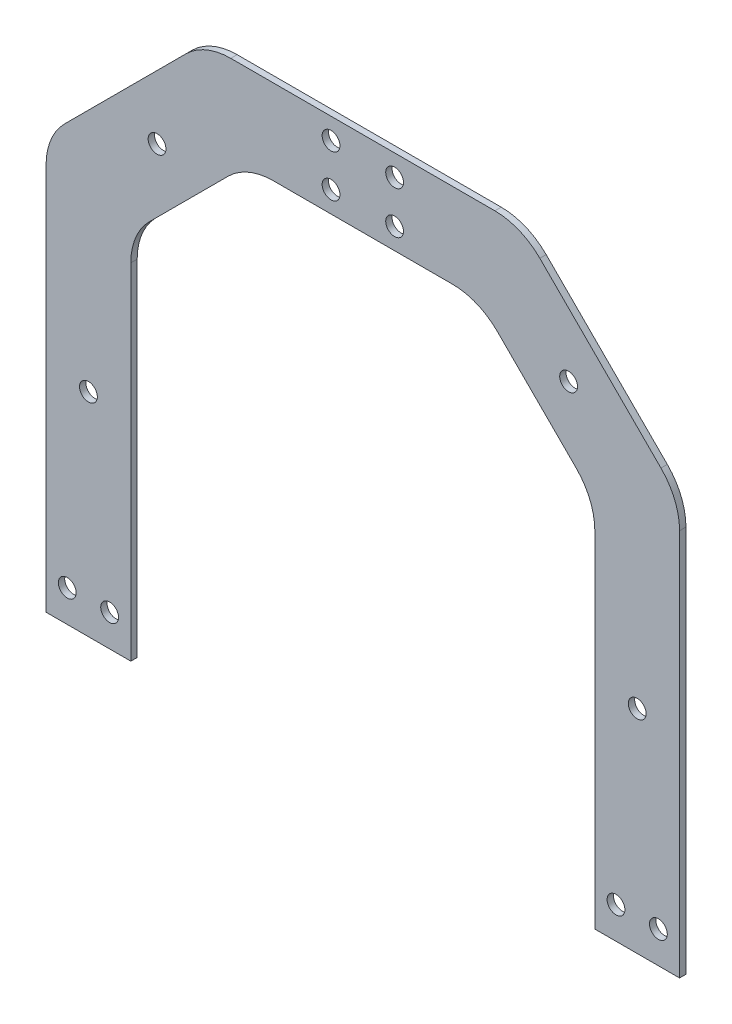
ISO-10303-21;
HEADER;
FILE_DESCRIPTION(('STEP AP214'),'2;1');
FILE_NAME('part.step','',(''),(''),'','','');
FILE_SCHEMA(('AUTOMOTIVE_DESIGN { 1 0 10303 214 1 1 1 1 }'));
ENDSEC;
DATA;
#1=APPLICATION_CONTEXT('core data for automotive mechanical design processes');
#2=APPLICATION_PROTOCOL_DEFINITION('international standard','automotive_design',2000,#1);
#3=PRODUCT_CONTEXT('',#1,'mechanical');
#4=PRODUCT('Part','Part','',(#3));
#5=PRODUCT_RELATED_PRODUCT_CATEGORY('part','',(#4));
#6=PRODUCT_DEFINITION_FORMATION('','',#4);
#7=PRODUCT_DEFINITION_CONTEXT('part definition',#1,'design');
#8=PRODUCT_DEFINITION('design','',#6,#7);
#9=PRODUCT_DEFINITION_SHAPE('','',#8);
#10=(LENGTH_UNIT() NAMED_UNIT(*) SI_UNIT(.MILLI.,.METRE.));
#11=(NAMED_UNIT(*) PLANE_ANGLE_UNIT() SI_UNIT($,.RADIAN.));
#12=(NAMED_UNIT(*) SI_UNIT($,.STERADIAN.) SOLID_ANGLE_UNIT());
#13=UNCERTAINTY_MEASURE_WITH_UNIT(LENGTH_MEASURE(1.E-05),#10,'distance_accuracy_value','');
#14=(GEOMETRIC_REPRESENTATION_CONTEXT(3) GLOBAL_UNCERTAINTY_ASSIGNED_CONTEXT((#13)) GLOBAL_UNIT_ASSIGNED_CONTEXT((#10,
#11,#12)) REPRESENTATION_CONTEXT('',''));
#15=CARTESIAN_POINT('',(0.,0.,0.));
#16=DIRECTION('',(0.,0.,1.));
#17=DIRECTION('',(1.,0.,0.));
#18=AXIS2_PLACEMENT_3D('',#15,#16,#17);
#19=CARTESIAN_POINT('',(109.5,0.,3.));
#20=DIRECTION('',(0.,1.,0.));
#21=DIRECTION('',(-1.,0.,0.));
#22=AXIS2_PLACEMENT_3D('',#19,#20,#21);
#23=PLANE('',#22);
#24=DIRECTION('',(1.,0.,0.));
#25=VECTOR('',#24,1.);
#26=CARTESIAN_POINT('',(109.5,0.,0.));
#27=LINE('',#26,#25);
#28=CARTESIAN_POINT('',(109.5,0.,0.));
#29=VERTEX_POINT('',#28);
#30=CARTESIAN_POINT('',(149.5,0.,0.));
#31=VERTEX_POINT('',#30);
#32=EDGE_CURVE('E203',#29,#31,#27,.T.);
#33=ORIENTED_EDGE('',*,*,#32,.T.);
#34=DIRECTION('',(0.,0.,-1.));
#35=VECTOR('',#34,1.);
#36=CARTESIAN_POINT('',(149.5,0.,3.));
#37=LINE('',#36,#35);
#38=CARTESIAN_POINT('',(149.5,0.,3.));
#39=VERTEX_POINT('',#38);
#40=EDGE_CURVE('E11',#39,#31,#37,.T.);
#41=ORIENTED_EDGE('',*,*,#40,.F.);
#42=DIRECTION('',(1.,0.,0.));
#43=VECTOR('',#42,1.);
#44=CARTESIAN_POINT('',(109.5,0.,3.));
#45=LINE('',#44,#43);
#46=CARTESIAN_POINT('',(109.5,0.,3.));
#47=VERTEX_POINT('',#46);
#48=EDGE_CURVE('E242',#47,#39,#45,.T.);
#49=ORIENTED_EDGE('',*,*,#48,.F.);
#50=DIRECTION('',(0.,0.,-1.));
#51=VECTOR('',#50,1.);
#52=CARTESIAN_POINT('',(109.5,0.,3.));
#53=LINE('',#52,#51);
#54=EDGE_CURVE('E199',#47,#29,#53,.T.);
#55=ORIENTED_EDGE('',*,*,#54,.T.);
#56=EDGE_LOOP('',(#33,#41,#49,#55));
#57=FACE_BOUND('',#56,.T.);
#58=ADVANCED_FACE('F35',(#57),#23,.F.);
#59=CARTESIAN_POINT('',(149.5,182.823593128805,3.));
#60=DIRECTION('',(-1.,0.,0.));
#61=DIRECTION('',(0.,0.,1.));
#62=AXIS2_PLACEMENT_3D('',#59,#60,#61);
#63=PLANE('',#62);
#64=DIRECTION('',(0.,1.,0.));
#65=VECTOR('',#64,1.);
#66=CARTESIAN_POINT('',(149.5,182.823593128805,0.));
#67=LINE('',#66,#65);
#68=CARTESIAN_POINT('',(149.5,182.823593128805,0.));
#69=VERTEX_POINT('',#68);
#70=EDGE_CURVE('E206',#31,#69,#67,.T.);
#71=ORIENTED_EDGE('',*,*,#70,.T.);
#72=DIRECTION('',(0.,0.,-1.));
#73=VECTOR('',#72,1.);
#74=CARTESIAN_POINT('',(149.5,182.823593128805,3.));
#75=LINE('',#74,#73);
#76=CARTESIAN_POINT('',(149.5,182.823593128805,3.));
#77=VERTEX_POINT('',#76);
#78=EDGE_CURVE('E43',#77,#69,#75,.T.);
#79=ORIENTED_EDGE('',*,*,#78,.F.);
#80=DIRECTION('',(0.,1.,0.));
#81=VECTOR('',#80,1.);
#82=CARTESIAN_POINT('',(149.5,182.823593128805,3.));
#83=LINE('',#82,#81);
#84=EDGE_CURVE('E130',#39,#77,#83,.T.);
#85=ORIENTED_EDGE('',*,*,#84,.F.);
#86=ORIENTED_EDGE('',*,*,#40,.T.);
#87=EDGE_LOOP('',(#71,#79,#85,#86));
#88=FACE_BOUND('',#87,.T.);
#89=ADVANCED_FACE('F361',(#88),#63,.F.);
#90=CARTESIAN_POINT('',(119.499999999992,182.823593128805,3.));
#91=DIRECTION('',(0.,0.,-1.));
#92=DIRECTION('',(-1.,0.,0.));
#93=AXIS2_PLACEMENT_3D('',#90,#91,#92);
#94=CYLINDRICAL_SURFACE('',#93,30.0000000000081);
#95=CARTESIAN_POINT('',(119.499999999992,182.823593128805,0.));
#96=DIRECTION('',(0.,0.,1.));
#97=DIRECTION('',(1.,0.,0.));
#98=AXIS2_PLACEMENT_3D('',#95,#96,#97);
#99=CIRCLE('',#98,30.0000000000081);
#100=CARTESIAN_POINT('',(140.713203435594,204.036796564407,0.));
#101=VERTEX_POINT('',#100);
#102=EDGE_CURVE('E209',#69,#101,#99,.T.);
#103=ORIENTED_EDGE('',*,*,#102,.T.);
#104=DIRECTION('',(0.,0.,-1.));
#105=VECTOR('',#104,1.);
#106=CARTESIAN_POINT('',(140.713203435594,204.036796564407,3.));
#107=LINE('',#106,#105);
#108=CARTESIAN_POINT('',(140.713203435594,204.036796564407,3.));
#109=VERTEX_POINT('',#108);
#110=EDGE_CURVE('E285',#109,#101,#107,.T.);
#111=ORIENTED_EDGE('',*,*,#110,.F.);
#112=CARTESIAN_POINT('',(119.499999999992,182.823593128805,3.));
#113=DIRECTION('',(0.,0.,1.));
#114=DIRECTION('',(1.,0.,0.));
#115=AXIS2_PLACEMENT_3D('',#112,#113,#114);
#116=CIRCLE('',#115,30.0000000000081);
#117=EDGE_CURVE('E293',#77,#109,#116,.T.);
#118=ORIENTED_EDGE('',*,*,#117,.F.);
#119=ORIENTED_EDGE('',*,*,#78,.T.);
#120=EDGE_LOOP('',(#103,#111,#118,#119));
#121=FACE_BOUND('',#120,.T.);
#122=ADVANCED_FACE('F291',(#121),#94,.T.);
#123=CARTESIAN_POINT('',(83.536796564406,261.213203435594,3.));
#124=DIRECTION('',(-0.707106781186544,-0.707106781186551,0.));
#125=DIRECTION('',(0.707106781186551,-0.707106781186544,0.));
#126=AXIS2_PLACEMENT_3D('',#123,#124,#125);
#127=PLANE('',#126);
#128=DIRECTION('',(-0.707106781186551,0.707106781186544,0.));
#129=VECTOR('',#128,1.);
#130=CARTESIAN_POINT('',(83.536796564406,261.213203435594,0.));
#131=LINE('',#130,#129);
#132=CARTESIAN_POINT('',(83.536796564406,261.213203435594,0.));
#133=VERTEX_POINT('',#132);
#134=EDGE_CURVE('E211',#101,#133,#131,.T.);
#135=ORIENTED_EDGE('',*,*,#134,.T.);
#136=DIRECTION('',(0.,0.,-1.));
#137=VECTOR('',#136,1.);
#138=CARTESIAN_POINT('',(83.536796564406,261.213203435594,3.));
#139=LINE('',#138,#137);
#140=CARTESIAN_POINT('',(83.536796564406,261.213203435594,3.));
#141=VERTEX_POINT('',#140);
#142=EDGE_CURVE('E282',#141,#133,#139,.T.);
#143=ORIENTED_EDGE('',*,*,#142,.F.);
#144=DIRECTION('',(-0.707106781186551,0.707106781186544,0.));
#145=VECTOR('',#144,1.);
#146=CARTESIAN_POINT('',(83.536796564406,261.213203435594,3.));
#147=LINE('',#146,#145);
#148=EDGE_CURVE('E311',#109,#141,#147,.T.);
#149=ORIENTED_EDGE('',*,*,#148,.F.);
#150=ORIENTED_EDGE('',*,*,#110,.T.);
#151=EDGE_LOOP('',(#135,#143,#149,#150));
#152=FACE_BOUND('',#151,.T.);
#153=ADVANCED_FACE('F302',(#152),#127,.F.);
#154=CARTESIAN_POINT('',(62.323593128804,239.999999999992,3.));
#155=DIRECTION('',(0.,0.,-1.));
#156=DIRECTION('',(-1.,0.,0.));
#157=AXIS2_PLACEMENT_3D('',#154,#155,#156);
#158=CYLINDRICAL_SURFACE('',#157,30.0000000000081);
#159=CARTESIAN_POINT('',(62.323593128804,239.999999999992,0.));
#160=DIRECTION('',(0.,0.,1.));
#161=DIRECTION('',(1.,0.,0.));
#162=AXIS2_PLACEMENT_3D('',#159,#160,#161);
#163=CIRCLE('',#162,30.0000000000081);
#164=CARTESIAN_POINT('',(62.323593128804,270.,0.));
#165=VERTEX_POINT('',#164);
#166=EDGE_CURVE('E213',#133,#165,#163,.T.);
#167=ORIENTED_EDGE('',*,*,#166,.T.);
#168=DIRECTION('',(0.,0.,-1.));
#169=VECTOR('',#168,1.);
#170=CARTESIAN_POINT('',(62.323593128804,270.,3.));
#171=LINE('',#170,#169);
#172=CARTESIAN_POINT('',(62.323593128804,270.,3.));
#173=VERTEX_POINT('',#172);
#174=EDGE_CURVE('E279',#173,#165,#171,.T.);
#175=ORIENTED_EDGE('',*,*,#174,.F.);
#176=CARTESIAN_POINT('',(62.323593128804,239.999999999992,3.));
#177=DIRECTION('',(0.,0.,1.));
#178=DIRECTION('',(1.,0.,0.));
#179=AXIS2_PLACEMENT_3D('',#176,#177,#178);
#180=CIRCLE('',#179,30.0000000000081);
#181=EDGE_CURVE('E308',#141,#173,#180,.T.);
#182=ORIENTED_EDGE('',*,*,#181,.F.);
#183=ORIENTED_EDGE('',*,*,#142,.T.);
#184=EDGE_LOOP('',(#167,#175,#182,#183));
#185=FACE_BOUND('',#184,.T.);
#186=ADVANCED_FACE('F306',(#185),#158,.T.);
#187=CARTESIAN_POINT('',(62.323593128804,270.,3.));
#188=DIRECTION('',(0.,-1.,0.));
#189=DIRECTION('',(0.,0.,-1.));
#190=AXIS2_PLACEMENT_3D('',#187,#188,#189);
#191=PLANE('',#190);
#192=DIRECTION('',(-1.,0.,0.));
#193=VECTOR('',#192,1.);
#194=CARTESIAN_POINT('',(62.323593128804,270.,0.));
#195=LINE('',#194,#193);
#196=CARTESIAN_POINT('',(-62.323593128804,270.,0.));
#197=VERTEX_POINT('',#196);
#198=EDGE_CURVE('E215',#165,#197,#195,.T.);
#199=ORIENTED_EDGE('',*,*,#198,.T.);
#200=DIRECTION('',(0.,0.,-1.));
#201=VECTOR('',#200,1.);
#202=CARTESIAN_POINT('',(-62.323593128804,270.,3.));
#203=LINE('',#202,#201);
#204=CARTESIAN_POINT('',(-62.323593128804,270.,3.));
#205=VERTEX_POINT('',#204);
#206=EDGE_CURVE('E276',#205,#197,#203,.T.);
#207=ORIENTED_EDGE('',*,*,#206,.F.);
#208=DIRECTION('',(-1.,0.,0.));
#209=VECTOR('',#208,1.);
#210=CARTESIAN_POINT('',(62.323593128804,270.,3.));
#211=LINE('',#210,#209);
#212=EDGE_CURVE('E310',#173,#205,#211,.T.);
#213=ORIENTED_EDGE('',*,*,#212,.F.);
#214=ORIENTED_EDGE('',*,*,#174,.T.);
#215=EDGE_LOOP('',(#199,#207,#213,#214));
#216=FACE_BOUND('',#215,.T.);
#217=ADVANCED_FACE('F374',(#216),#191,.F.);
#218=CARTESIAN_POINT('',(-62.323593128804,239.999999999992,3.));
#219=DIRECTION('',(0.,0.,-1.));
#220=DIRECTION('',(-1.,0.,0.));
#221=AXIS2_PLACEMENT_3D('',#218,#219,#220);
#222=CYLINDRICAL_SURFACE('',#221,30.0000000000081);
#223=CARTESIAN_POINT('',(-62.323593128804,239.999999999992,0.));
#224=DIRECTION('',(0.,0.,1.));
#225=DIRECTION('',(-1.,0.,0.));
#226=AXIS2_PLACEMENT_3D('',#223,#224,#225);
#227=CIRCLE('',#226,30.0000000000081);
#228=CARTESIAN_POINT('',(-83.536796564406,261.213203435594,0.));
#229=VERTEX_POINT('',#228);
#230=EDGE_CURVE('E217',#197,#229,#227,.T.);
#231=ORIENTED_EDGE('',*,*,#230,.T.);
#232=DIRECTION('',(0.,0.,-1.));
#233=VECTOR('',#232,1.);
#234=CARTESIAN_POINT('',(-83.536796564406,261.213203435594,3.));
#235=LINE('',#234,#233);
#236=CARTESIAN_POINT('',(-83.536796564406,261.213203435594,3.));
#237=VERTEX_POINT('',#236);
#238=EDGE_CURVE('E273',#237,#229,#235,.T.);
#239=ORIENTED_EDGE('',*,*,#238,.F.);
#240=CARTESIAN_POINT('',(-62.323593128804,239.999999999992,3.));
#241=DIRECTION('',(0.,0.,1.));
#242=DIRECTION('',(-1.,0.,0.));
#243=AXIS2_PLACEMENT_3D('',#240,#241,#242);
#244=CIRCLE('',#243,30.0000000000081);
#245=EDGE_CURVE('E313',#205,#237,#244,.T.);
#246=ORIENTED_EDGE('',*,*,#245,.F.);
#247=ORIENTED_EDGE('',*,*,#206,.T.);
#248=EDGE_LOOP('',(#231,#239,#246,#247));
#249=FACE_BOUND('',#248,.T.);
#250=ADVANCED_FACE('F377',(#249),#222,.T.);
#251=CARTESIAN_POINT('',(-83.536796564406,261.213203435594,3.));
#252=DIRECTION('',(0.707106781186544,-0.707106781186551,0.));
#253=DIRECTION('',(0.707106781186551,0.707106781186544,0.));
#254=AXIS2_PLACEMENT_3D('',#251,#252,#253);
#255=PLANE('',#254);
#256=DIRECTION('',(-0.707106781186551,-0.707106781186544,0.));
#257=VECTOR('',#256,1.);
#258=CARTESIAN_POINT('',(-83.536796564406,261.213203435594,0.));
#259=LINE('',#258,#257);
#260=CARTESIAN_POINT('',(-140.713203435594,204.036796564407,0.));
#261=VERTEX_POINT('',#260);
#262=EDGE_CURVE('E219',#229,#261,#259,.T.);
#263=ORIENTED_EDGE('',*,*,#262,.T.);
#264=DIRECTION('',(0.,0.,-1.));
#265=VECTOR('',#264,1.);
#266=CARTESIAN_POINT('',(-140.713203435594,204.036796564407,3.));
#267=LINE('',#266,#265);
#268=CARTESIAN_POINT('',(-140.713203435594,204.036796564407,3.));
#269=VERTEX_POINT('',#268);
#270=EDGE_CURVE('E270',#269,#261,#267,.T.);
#271=ORIENTED_EDGE('',*,*,#270,.F.);
#272=DIRECTION('',(-0.707106781186551,-0.707106781186544,0.));
#273=VECTOR('',#272,1.);
#274=CARTESIAN_POINT('',(-83.536796564406,261.213203435594,3.));
#275=LINE('',#274,#273);
#276=EDGE_CURVE('E319',#237,#269,#275,.T.);
#277=ORIENTED_EDGE('',*,*,#276,.F.);
#278=ORIENTED_EDGE('',*,*,#238,.T.);
#279=EDGE_LOOP('',(#263,#271,#277,#278));
#280=FACE_BOUND('',#279,.T.);
#281=ADVANCED_FACE('F381',(#280),#255,.F.);
#282=CARTESIAN_POINT('',(-119.499999999992,182.823593128805,3.));
#283=DIRECTION('',(0.,0.,-1.));
#284=DIRECTION('',(-1.,0.,0.));
#285=AXIS2_PLACEMENT_3D('',#282,#283,#284);
#286=CYLINDRICAL_SURFACE('',#285,30.0000000000081);
#287=CARTESIAN_POINT('',(-119.499999999992,182.823593128805,0.));
#288=DIRECTION('',(0.,0.,1.));
#289=DIRECTION('',(1.,0.,0.));
#290=AXIS2_PLACEMENT_3D('',#287,#288,#289);
#291=CIRCLE('',#290,30.0000000000081);
#292=CARTESIAN_POINT('',(-149.5,182.823593128805,0.));
#293=VERTEX_POINT('',#292);
#294=EDGE_CURVE('E221',#261,#293,#291,.T.);
#295=ORIENTED_EDGE('',*,*,#294,.T.);
#296=DIRECTION('',(0.,0.,-1.));
#297=VECTOR('',#296,1.);
#298=CARTESIAN_POINT('',(-149.5,182.823593128805,3.));
#299=LINE('',#298,#297);
#300=CARTESIAN_POINT('',(-149.5,182.823593128805,3.));
#301=VERTEX_POINT('',#300);
#302=EDGE_CURVE('E267',#301,#293,#299,.T.);
#303=ORIENTED_EDGE('',*,*,#302,.F.);
#304=CARTESIAN_POINT('',(-119.499999999992,182.823593128805,3.));
#305=DIRECTION('',(0.,0.,1.));
#306=DIRECTION('',(1.,0.,0.));
#307=AXIS2_PLACEMENT_3D('',#304,#305,#306);
#308=CIRCLE('',#307,30.0000000000081);
#309=EDGE_CURVE('E321',#269,#301,#308,.T.);
#310=ORIENTED_EDGE('',*,*,#309,.F.);
#311=ORIENTED_EDGE('',*,*,#270,.T.);
#312=EDGE_LOOP('',(#295,#303,#310,#311));
#313=FACE_BOUND('',#312,.T.);
#314=ADVANCED_FACE('F385',(#313),#286,.T.);
#315=CARTESIAN_POINT('',(-149.5,182.823593128805,3.));
#316=DIRECTION('',(1.,0.,0.));
#317=DIRECTION('',(0.,0.,-1.));
#318=AXIS2_PLACEMENT_3D('',#315,#316,#317);
#319=PLANE('',#318);
#320=DIRECTION('',(0.,-1.,0.));
#321=VECTOR('',#320,1.);
#322=CARTESIAN_POINT('',(-149.5,182.823593128805,0.));
#323=LINE('',#322,#321);
#324=CARTESIAN_POINT('',(-149.5,0.,0.));
#325=VERTEX_POINT('',#324);
#326=EDGE_CURVE('E223',#293,#325,#323,.T.);
#327=ORIENTED_EDGE('',*,*,#326,.T.);
#328=DIRECTION('',(0.,0.,-1.));
#329=VECTOR('',#328,1.);
#330=CARTESIAN_POINT('',(-149.5,0.,3.));
#331=LINE('',#330,#329);
#332=CARTESIAN_POINT('',(-149.5,0.,3.));
#333=VERTEX_POINT('',#332);
#334=EDGE_CURVE('E264',#333,#325,#331,.T.);
#335=ORIENTED_EDGE('',*,*,#334,.F.);
#336=DIRECTION('',(0.,-1.,0.));
#337=VECTOR('',#336,1.);
#338=CARTESIAN_POINT('',(-149.5,182.823593128805,3.));
#339=LINE('',#338,#337);
#340=EDGE_CURVE('E323',#301,#333,#339,.T.);
#341=ORIENTED_EDGE('',*,*,#340,.F.);
#342=ORIENTED_EDGE('',*,*,#302,.T.);
#343=EDGE_LOOP('',(#327,#335,#341,#342));
#344=FACE_BOUND('',#343,.T.);
#345=ADVANCED_FACE('F389',(#344),#319,.F.);
#346=CARTESIAN_POINT('',(-109.5,0.,3.));
#347=DIRECTION('',(0.,1.,0.));
#348=DIRECTION('',(-1.,0.,0.));
#349=AXIS2_PLACEMENT_3D('',#346,#347,#348);
#350=PLANE('',#349);
#351=DIRECTION('',(1.,0.,0.));
#352=VECTOR('',#351,1.);
#353=CARTESIAN_POINT('',(-109.5,0.,0.));
#354=LINE('',#353,#352);
#355=CARTESIAN_POINT('',(-109.5,0.,0.));
#356=VERTEX_POINT('',#355);
#357=EDGE_CURVE('E225',#325,#356,#354,.T.);
#358=ORIENTED_EDGE('',*,*,#357,.T.);
#359=DIRECTION('',(0.,0.,-1.));
#360=VECTOR('',#359,1.);
#361=CARTESIAN_POINT('',(-109.5,0.,3.));
#362=LINE('',#361,#360);
#363=CARTESIAN_POINT('',(-109.5,0.,3.));
#364=VERTEX_POINT('',#363);
#365=EDGE_CURVE('E261',#364,#356,#362,.T.);
#366=ORIENTED_EDGE('',*,*,#365,.F.);
#367=DIRECTION('',(1.,0.,0.));
#368=VECTOR('',#367,1.);
#369=CARTESIAN_POINT('',(-109.5,0.,3.));
#370=LINE('',#369,#368);
#371=EDGE_CURVE('E325',#333,#364,#370,.T.);
#372=ORIENTED_EDGE('',*,*,#371,.F.);
#373=ORIENTED_EDGE('',*,*,#334,.T.);
#374=EDGE_LOOP('',(#358,#366,#372,#373));
#375=FACE_BOUND('',#374,.T.);
#376=ADVANCED_FACE('F393',(#375),#350,.F.);
#377=CARTESIAN_POINT('',(-109.5,162.823593128805,3.));
#378=DIRECTION('',(-1.,0.,0.));
#379=DIRECTION('',(0.,-1.,0.));
#380=AXIS2_PLACEMENT_3D('',#377,#378,#379);
#381=PLANE('',#380);
#382=DIRECTION('',(0.,1.,0.));
#383=VECTOR('',#382,1.);
#384=CARTESIAN_POINT('',(-109.5,162.823593128805,0.));
#385=LINE('',#384,#383);
#386=CARTESIAN_POINT('',(-109.5,162.823593128805,0.));
#387=VERTEX_POINT('',#386);
#388=EDGE_CURVE('E227',#356,#387,#385,.T.);
#389=ORIENTED_EDGE('',*,*,#388,.T.);
#390=DIRECTION('',(0.,0.,-1.));
#391=VECTOR('',#390,1.);
#392=CARTESIAN_POINT('',(-109.5,162.823593128805,3.));
#393=LINE('',#392,#391);
#394=CARTESIAN_POINT('',(-109.5,162.823593128805,3.));
#395=VERTEX_POINT('',#394);
#396=EDGE_CURVE('E258',#395,#387,#393,.T.);
#397=ORIENTED_EDGE('',*,*,#396,.F.);
#398=DIRECTION('',(0.,1.,0.));
#399=VECTOR('',#398,1.);
#400=CARTESIAN_POINT('',(-109.5,162.823593128805,3.));
#401=LINE('',#400,#399);
#402=EDGE_CURVE('E327',#364,#395,#401,.T.);
#403=ORIENTED_EDGE('',*,*,#402,.F.);
#404=ORIENTED_EDGE('',*,*,#365,.T.);
#405=EDGE_LOOP('',(#389,#397,#403,#404));
#406=FACE_BOUND('',#405,.T.);
#407=ADVANCED_FACE('F397',(#406),#381,.F.);
#408=CARTESIAN_POINT('',(-79.4999999999919,162.823593128805,3.));
#409=DIRECTION('',(0.,0.,-1.));
#410=DIRECTION('',(-1.,0.,0.));
#411=AXIS2_PLACEMENT_3D('',#408,#409,#410);
#412=CYLINDRICAL_SURFACE('',#411,30.0000000000081);
#413=CARTESIAN_POINT('',(-79.4999999999919,162.823593128805,0.));
#414=DIRECTION('',(0.,0.,-1.));
#415=DIRECTION('',(1.,0.,0.));
#416=AXIS2_PLACEMENT_3D('',#413,#414,#415);
#417=CIRCLE('',#416,30.0000000000081);
#418=CARTESIAN_POINT('',(-100.713203435594,184.036796564407,0.));
#419=VERTEX_POINT('',#418);
#420=EDGE_CURVE('E229',#387,#419,#417,.T.);
#421=ORIENTED_EDGE('',*,*,#420,.T.);
#422=DIRECTION('',(0.,0.,-1.));
#423=VECTOR('',#422,1.);
#424=CARTESIAN_POINT('',(-100.713203435594,184.036796564407,3.));
#425=LINE('',#424,#423);
#426=CARTESIAN_POINT('',(-100.713203435594,184.036796564407,3.));
#427=VERTEX_POINT('',#426);
#428=EDGE_CURVE('E255',#427,#419,#425,.T.);
#429=ORIENTED_EDGE('',*,*,#428,.F.);
#430=CARTESIAN_POINT('',(-79.4999999999919,162.823593128805,3.));
#431=DIRECTION('',(0.,0.,-1.));
#432=DIRECTION('',(1.,0.,0.));
#433=AXIS2_PLACEMENT_3D('',#430,#431,#432);
#434=CIRCLE('',#433,30.0000000000081);
#435=EDGE_CURVE('E329',#395,#427,#434,.T.);
#436=ORIENTED_EDGE('',*,*,#435,.F.);
#437=ORIENTED_EDGE('',*,*,#396,.T.);
#438=EDGE_LOOP('',(#421,#429,#436,#437));
#439=FACE_BOUND('',#438,.T.);
#440=ADVANCED_FACE('F401',(#439),#412,.F.);
#441=CARTESIAN_POINT('',(-63.5367965644059,221.213203435594,3.));
#442=DIRECTION('',(-0.707106781186539,0.707106781186556,0.));
#443=DIRECTION('',(-0.707106781186556,-0.707106781186539,0.));
#444=AXIS2_PLACEMENT_3D('',#441,#442,#443);
#445=PLANE('',#444);
#446=DIRECTION('',(0.707106781186556,0.707106781186539,0.));
#447=VECTOR('',#446,1.);
#448=CARTESIAN_POINT('',(-63.5367965644059,221.213203435594,0.));
#449=LINE('',#448,#447);
#450=CARTESIAN_POINT('',(-63.5367965644059,221.213203435594,0.));
#451=VERTEX_POINT('',#450);
#452=EDGE_CURVE('E231',#419,#451,#449,.T.);
#453=ORIENTED_EDGE('',*,*,#452,.T.);
#454=DIRECTION('',(0.,0.,-1.));
#455=VECTOR('',#454,1.);
#456=CARTESIAN_POINT('',(-63.5367965644059,221.213203435594,3.));
#457=LINE('',#456,#455);
#458=CARTESIAN_POINT('',(-63.5367965644059,221.213203435594,3.));
#459=VERTEX_POINT('',#458);
#460=EDGE_CURVE('E252',#459,#451,#457,.T.);
#461=ORIENTED_EDGE('',*,*,#460,.F.);
#462=DIRECTION('',(0.707106781186556,0.707106781186539,0.));
#463=VECTOR('',#462,1.);
#464=CARTESIAN_POINT('',(-63.5367965644059,221.213203435594,3.));
#465=LINE('',#464,#463);
#466=EDGE_CURVE('E331',#427,#459,#465,.T.);
#467=ORIENTED_EDGE('',*,*,#466,.F.);
#468=ORIENTED_EDGE('',*,*,#428,.T.);
#469=EDGE_LOOP('',(#453,#461,#467,#468));
#470=FACE_BOUND('',#469,.T.);
#471=ADVANCED_FACE('F405',(#470),#445,.F.);
#472=CARTESIAN_POINT('',(-42.323593128804,199.999999999992,3.));
#473=DIRECTION('',(0.,0.,-1.));
#474=DIRECTION('',(-1.,0.,0.));
#475=AXIS2_PLACEMENT_3D('',#472,#473,#474);
#476=CYLINDRICAL_SURFACE('',#475,30.0000000000081);
#477=CARTESIAN_POINT('',(-42.323593128804,199.999999999992,0.));
#478=DIRECTION('',(0.,0.,-1.));
#479=DIRECTION('',(-1.,0.,0.));
#480=AXIS2_PLACEMENT_3D('',#477,#478,#479);
#481=CIRCLE('',#480,30.0000000000081);
#482=CARTESIAN_POINT('',(-42.323593128804,230.,0.));
#483=VERTEX_POINT('',#482);
#484=EDGE_CURVE('E233',#451,#483,#481,.T.);
#485=ORIENTED_EDGE('',*,*,#484,.T.);
#486=DIRECTION('',(0.,0.,-1.));
#487=VECTOR('',#486,1.);
#488=CARTESIAN_POINT('',(-42.323593128804,230.,3.));
#489=LINE('',#488,#487);
#490=CARTESIAN_POINT('',(-42.323593128804,230.,3.));
#491=VERTEX_POINT('',#490);
#492=EDGE_CURVE('E249',#491,#483,#489,.T.);
#493=ORIENTED_EDGE('',*,*,#492,.F.);
#494=CARTESIAN_POINT('',(-42.323593128804,199.999999999992,3.));
#495=DIRECTION('',(0.,0.,-1.));
#496=DIRECTION('',(-1.,0.,0.));
#497=AXIS2_PLACEMENT_3D('',#494,#495,#496);
#498=CIRCLE('',#497,30.0000000000081);
#499=EDGE_CURVE('E333',#459,#491,#498,.T.);
#500=ORIENTED_EDGE('',*,*,#499,.F.);
#501=ORIENTED_EDGE('',*,*,#460,.T.);
#502=EDGE_LOOP('',(#485,#493,#500,#501));
#503=FACE_BOUND('',#502,.T.);
#504=ADVANCED_FACE('F409',(#503),#476,.F.);
#505=CARTESIAN_POINT('',(42.323593128804,230.,3.));
#506=DIRECTION('',(0.,1.,0.));
#507=DIRECTION('',(0.,0.,1.));
#508=AXIS2_PLACEMENT_3D('',#505,#506,#507);
#509=PLANE('',#508);
#510=DIRECTION('',(1.,0.,0.));
#511=VECTOR('',#510,1.);
#512=CARTESIAN_POINT('',(42.323593128804,230.,0.));
#513=LINE('',#512,#511);
#514=CARTESIAN_POINT('',(42.323593128804,230.,0.));
#515=VERTEX_POINT('',#514);
#516=EDGE_CURVE('E235',#483,#515,#513,.T.);
#517=ORIENTED_EDGE('',*,*,#516,.T.);
#518=DIRECTION('',(0.,0.,-1.));
#519=VECTOR('',#518,1.);
#520=CARTESIAN_POINT('',(42.323593128804,230.,3.));
#521=LINE('',#520,#519);
#522=CARTESIAN_POINT('',(42.323593128804,230.,3.));
#523=VERTEX_POINT('',#522);
#524=EDGE_CURVE('E246',#523,#515,#521,.T.);
#525=ORIENTED_EDGE('',*,*,#524,.F.);
#526=DIRECTION('',(1.,0.,0.));
#527=VECTOR('',#526,1.);
#528=CARTESIAN_POINT('',(42.323593128804,230.,3.));
#529=LINE('',#528,#527);
#530=EDGE_CURVE('E335',#491,#523,#529,.T.);
#531=ORIENTED_EDGE('',*,*,#530,.F.);
#532=ORIENTED_EDGE('',*,*,#492,.T.);
#533=EDGE_LOOP('',(#517,#525,#531,#532));
#534=FACE_BOUND('',#533,.T.);
#535=ADVANCED_FACE('F341',(#534),#509,.F.);
#536=CARTESIAN_POINT('',(42.323593128804,199.999999999992,3.));
#537=DIRECTION('',(0.,0.,-1.));
#538=DIRECTION('',(-1.,0.,0.));
#539=AXIS2_PLACEMENT_3D('',#536,#537,#538);
#540=CYLINDRICAL_SURFACE('',#539,30.0000000000081);
#541=CARTESIAN_POINT('',(42.323593128804,199.999999999992,0.));
#542=DIRECTION('',(0.,0.,-1.));
#543=DIRECTION('',(1.,0.,0.));
#544=AXIS2_PLACEMENT_3D('',#541,#542,#543);
#545=CIRCLE('',#544,30.0000000000081);
#546=CARTESIAN_POINT('',(63.5367965644058,221.213203435594,0.));
#547=VERTEX_POINT('',#546);
#548=EDGE_CURVE('E237',#515,#547,#545,.T.);
#549=ORIENTED_EDGE('',*,*,#548,.T.);
#550=DIRECTION('',(0.,0.,-1.));
#551=VECTOR('',#550,1.);
#552=CARTESIAN_POINT('',(63.5367965644058,221.213203435594,3.));
#553=LINE('',#552,#551);
#554=CARTESIAN_POINT('',(63.5367965644058,221.213203435594,3.));
#555=VERTEX_POINT('',#554);
#556=EDGE_CURVE('E194',#555,#547,#553,.T.);
#557=ORIENTED_EDGE('',*,*,#556,.F.);
#558=CARTESIAN_POINT('',(42.323593128804,199.999999999992,3.));
#559=DIRECTION('',(0.,0.,-1.));
#560=DIRECTION('',(1.,0.,0.));
#561=AXIS2_PLACEMENT_3D('',#558,#559,#560);
#562=CIRCLE('',#561,30.0000000000081);
#563=EDGE_CURVE('E185',#523,#555,#562,.T.);
#564=ORIENTED_EDGE('',*,*,#563,.F.);
#565=ORIENTED_EDGE('',*,*,#524,.T.);
#566=EDGE_LOOP('',(#549,#557,#564,#565));
#567=FACE_BOUND('',#566,.T.);
#568=ADVANCED_FACE('F345',(#567),#540,.F.);
#569=CARTESIAN_POINT('',(63.5367965644059,221.213203435594,3.));
#570=DIRECTION('',(0.707106781186539,0.707106781186556,0.));
#571=DIRECTION('',(-0.707106781186556,0.707106781186539,0.));
#572=AXIS2_PLACEMENT_3D('',#569,#570,#571);
#573=PLANE('',#572);
#574=DIRECTION('',(0.707106781186556,-0.707106781186539,0.));
#575=VECTOR('',#574,1.);
#576=CARTESIAN_POINT('',(63.5367965644059,221.213203435594,0.));
#577=LINE('',#576,#575);
#578=CARTESIAN_POINT('',(100.713203435594,184.036796564407,0.));
#579=VERTEX_POINT('',#578);
#580=EDGE_CURVE('E193',#547,#579,#577,.T.);
#581=ORIENTED_EDGE('',*,*,#580,.T.);
#582=DIRECTION('',(0.,0.,-1.));
#583=VECTOR('',#582,1.);
#584=CARTESIAN_POINT('',(100.713203435594,184.036796564407,3.));
#585=LINE('',#584,#583);
#586=CARTESIAN_POINT('',(100.713203435594,184.036796564407,3.));
#587=VERTEX_POINT('',#586);
#588=EDGE_CURVE('E190',#587,#579,#585,.T.);
#589=ORIENTED_EDGE('',*,*,#588,.F.);
#590=DIRECTION('',(0.707106781186556,-0.707106781186539,0.));
#591=VECTOR('',#590,1.);
#592=CARTESIAN_POINT('',(63.5367965644059,221.213203435594,3.));
#593=LINE('',#592,#591);
#594=EDGE_CURVE('E179',#555,#587,#593,.T.);
#595=ORIENTED_EDGE('',*,*,#594,.F.);
#596=ORIENTED_EDGE('',*,*,#556,.T.);
#597=EDGE_LOOP('',(#581,#589,#595,#596));
#598=FACE_BOUND('',#597,.T.);
#599=ADVANCED_FACE('F191',(#598),#573,.F.);
#600=CARTESIAN_POINT('',(79.4999999999919,162.823593128805,3.));
#601=DIRECTION('',(0.,0.,-1.));
#602=DIRECTION('',(-1.,0.,0.));
#603=AXIS2_PLACEMENT_3D('',#600,#601,#602);
#604=CYLINDRICAL_SURFACE('',#603,30.0000000000081);
#605=CARTESIAN_POINT('',(79.4999999999919,162.823593128805,0.));
#606=DIRECTION('',(0.,0.,-1.));
#607=DIRECTION('',(1.,0.,0.));
#608=AXIS2_PLACEMENT_3D('',#605,#606,#607);
#609=CIRCLE('',#608,30.0000000000081);
#610=CARTESIAN_POINT('',(109.5,162.823593128805,0.));
#611=VERTEX_POINT('',#610);
#612=EDGE_CURVE('E116',#579,#611,#609,.T.);
#613=ORIENTED_EDGE('',*,*,#612,.T.);
#614=DIRECTION('',(0.,0.,-1.));
#615=VECTOR('',#614,1.);
#616=CARTESIAN_POINT('',(109.5,162.823593128805,3.));
#617=LINE('',#616,#615);
#618=CARTESIAN_POINT('',(109.5,162.823593128805,3.));
#619=VERTEX_POINT('',#618);
#620=EDGE_CURVE('E195',#619,#611,#617,.T.);
#621=ORIENTED_EDGE('',*,*,#620,.F.);
#622=CARTESIAN_POINT('',(79.4999999999919,162.823593128805,3.));
#623=DIRECTION('',(0.,0.,-1.));
#624=DIRECTION('',(1.,0.,0.));
#625=AXIS2_PLACEMENT_3D('',#622,#623,#624);
#626=CIRCLE('',#625,30.0000000000081);
#627=EDGE_CURVE('E183',#587,#619,#626,.T.);
#628=ORIENTED_EDGE('',*,*,#627,.F.);
#629=ORIENTED_EDGE('',*,*,#588,.T.);
#630=EDGE_LOOP('',(#613,#621,#628,#629));
#631=FACE_BOUND('',#630,.T.);
#632=ADVANCED_FACE('F197',(#631),#604,.F.);
#633=CARTESIAN_POINT('',(109.5,162.823593128805,3.));
#634=DIRECTION('',(1.,0.,0.));
#635=DIRECTION('',(0.,1.,0.));
#636=AXIS2_PLACEMENT_3D('',#633,#634,#635);
#637=PLANE('',#636);
#638=DIRECTION('',(0.,-1.,0.));
#639=VECTOR('',#638,1.);
#640=CARTESIAN_POINT('',(109.5,162.823593128805,0.));
#641=LINE('',#640,#639);
#642=EDGE_CURVE('E122',#611,#29,#641,.T.);
#643=ORIENTED_EDGE('',*,*,#642,.T.);
#644=ORIENTED_EDGE('',*,*,#54,.F.);
#645=DIRECTION('',(0.,-1.,0.));
#646=VECTOR('',#645,1.);
#647=CARTESIAN_POINT('',(109.5,162.823593128805,3.));
#648=LINE('',#647,#646);
#649=EDGE_CURVE('E51',#619,#47,#648,.T.);
#650=ORIENTED_EDGE('',*,*,#649,.F.);
#651=ORIENTED_EDGE('',*,*,#620,.T.);
#652=EDGE_LOOP('',(#643,#644,#650,#651));
#653=FACE_BOUND('',#652,.T.);
#654=ADVANCED_FACE('F349',(#653),#637,.F.);
#655=CARTESIAN_POINT('',(119.499999999992,182.823593128805,3.));
#656=DIRECTION('',(0.,0.,1.));
#657=DIRECTION('',(1.,0.,0.));
#658=AXIS2_PLACEMENT_3D('',#655,#656,#657);
#659=PLANE('',#658);
#660=CARTESIAN_POINT('',(-119.5,15.,3.));
#661=DIRECTION('',(0.,0.,1.));
#662=DIRECTION('',(1.,0.,0.));
#663=AXIS2_PLACEMENT_3D('',#660,#661,#662);
#664=CIRCLE('',#663,4.2);
#665=CARTESIAN_POINT('',(-115.3,15.,3.));
#666=VERTEX_POINT('',#665);
#667=EDGE_CURVE('E575',#666,#666,#664,.T.);
#668=ORIENTED_EDGE('',*,*,#667,.F.);
#669=EDGE_LOOP('',(#668));
#670=FACE_BOUND('',#669,.T.);
#671=CARTESIAN_POINT('',(-139.5,15.,3.));
#672=DIRECTION('',(0.,0.,1.));
#673=DIRECTION('',(1.,0.,0.));
#674=AXIS2_PLACEMENT_3D('',#671,#672,#673);
#675=CIRCLE('',#674,4.20000000000001);
#676=CARTESIAN_POINT('',(-135.3,15.,3.));
#677=VERTEX_POINT('',#676);
#678=EDGE_CURVE('E577',#677,#677,#675,.T.);
#679=ORIENTED_EDGE('',*,*,#678,.F.);
#680=EDGE_LOOP('',(#679));
#681=FACE_BOUND('',#680,.T.);
#682=CARTESIAN_POINT('',(139.5,15.,3.));
#683=DIRECTION('',(0.,0.,1.));
#684=DIRECTION('',(1.,0.,0.));
#685=AXIS2_PLACEMENT_3D('',#682,#683,#684);
#686=CIRCLE('',#685,4.20000000000001);
#687=CARTESIAN_POINT('',(143.7,15.,3.));
#688=VERTEX_POINT('',#687);
#689=EDGE_CURVE('E585',#688,#688,#686,.T.);
#690=ORIENTED_EDGE('',*,*,#689,.F.);
#691=EDGE_LOOP('',(#690));
#692=FACE_BOUND('',#691,.T.);
#693=CARTESIAN_POINT('',(-15.,260.,3.));
#694=DIRECTION('',(0.,0.,1.));
#695=DIRECTION('',(1.,0.,0.));
#696=AXIS2_PLACEMENT_3D('',#693,#694,#695);
#697=CIRCLE('',#696,4.2);
#698=CARTESIAN_POINT('',(-10.8,260.,3.));
#699=VERTEX_POINT('',#698);
#700=EDGE_CURVE('E591',#699,#699,#697,.T.);
#701=ORIENTED_EDGE('',*,*,#700,.F.);
#702=EDGE_LOOP('',(#701));
#703=FACE_BOUND('',#702,.T.);
#704=CARTESIAN_POINT('',(-15.,240.,3.));
#705=DIRECTION('',(0.,0.,1.));
#706=DIRECTION('',(1.,0.,0.));
#707=AXIS2_PLACEMENT_3D('',#704,#705,#706);
#708=CIRCLE('',#707,4.2);
#709=CARTESIAN_POINT('',(-10.8,240.,3.));
#710=VERTEX_POINT('',#709);
#711=EDGE_CURVE('E597',#710,#710,#708,.T.);
#712=ORIENTED_EDGE('',*,*,#711,.F.);
#713=EDGE_LOOP('',(#712));
#714=FACE_BOUND('',#713,.T.);
#715=CARTESIAN_POINT('',(15.,240.,3.));
#716=DIRECTION('',(0.,0.,1.));
#717=DIRECTION('',(1.,0.,0.));
#718=AXIS2_PLACEMENT_3D('',#715,#716,#717);
#719=CIRCLE('',#718,4.2);
#720=CARTESIAN_POINT('',(19.2,240.,3.));
#721=VERTEX_POINT('',#720);
#722=EDGE_CURVE('E603',#721,#721,#719,.T.);
#723=ORIENTED_EDGE('',*,*,#722,.F.);
#724=EDGE_LOOP('',(#723));
#725=FACE_BOUND('',#724,.T.);
#726=CARTESIAN_POINT('',(15.,260.,3.));
#727=DIRECTION('',(0.,0.,1.));
#728=DIRECTION('',(1.,0.,0.));
#729=AXIS2_PLACEMENT_3D('',#726,#727,#728);
#730=CIRCLE('',#729,4.2);
#731=CARTESIAN_POINT('',(19.2,260.,3.));
#732=VERTEX_POINT('',#731);
#733=EDGE_CURVE('E609',#732,#732,#730,.T.);
#734=ORIENTED_EDGE('',*,*,#733,.F.);
#735=EDGE_LOOP('',(#734));
#736=FACE_BOUND('',#735,.T.);
#737=CARTESIAN_POINT('',(-129.5,100.125,3.));
#738=DIRECTION('',(0.,0.,1.));
#739=DIRECTION('',(1.,0.,0.));
#740=AXIS2_PLACEMENT_3D('',#737,#738,#739);
#741=CIRCLE('',#740,4.20000000000001);
#742=CARTESIAN_POINT('',(-125.3,100.125,3.));
#743=VERTEX_POINT('',#742);
#744=EDGE_CURVE('E615',#743,#743,#741,.T.);
#745=ORIENTED_EDGE('',*,*,#744,.F.);
#746=EDGE_LOOP('',(#745));
#747=FACE_BOUND('',#746,.T.);
#748=CARTESIAN_POINT('',(-97.1250000000003,217.625,3.));
#749=DIRECTION('',(0.,0.,1.));
#750=DIRECTION('',(1.,0.,0.));
#751=AXIS2_PLACEMENT_3D('',#748,#749,#750);
#752=CIRCLE('',#751,4.2);
#753=CARTESIAN_POINT('',(-92.9250000000003,217.625,3.));
#754=VERTEX_POINT('',#753);
#755=EDGE_CURVE('E621',#754,#754,#752,.T.);
#756=ORIENTED_EDGE('',*,*,#755,.F.);
#757=EDGE_LOOP('',(#756));
#758=FACE_BOUND('',#757,.T.);
#759=CARTESIAN_POINT('',(129.5,100.125,3.));
#760=DIRECTION('',(0.,0.,1.));
#761=DIRECTION('',(1.,0.,0.));
#762=AXIS2_PLACEMENT_3D('',#759,#760,#761);
#763=CIRCLE('',#762,4.20000000000001);
#764=CARTESIAN_POINT('',(133.7,100.125,3.));
#765=VERTEX_POINT('',#764);
#766=EDGE_CURVE('E627',#765,#765,#763,.T.);
#767=ORIENTED_EDGE('',*,*,#766,.F.);
#768=EDGE_LOOP('',(#767));
#769=FACE_BOUND('',#768,.T.);
#770=CARTESIAN_POINT('',(97.1250000000003,217.625,3.));
#771=DIRECTION('',(0.,0.,1.));
#772=DIRECTION('',(1.,0.,0.));
#773=AXIS2_PLACEMENT_3D('',#770,#771,#772);
#774=CIRCLE('',#773,4.2);
#775=CARTESIAN_POINT('',(101.325,217.625,3.));
#776=VERTEX_POINT('',#775);
#777=EDGE_CURVE('E633',#776,#776,#774,.T.);
#778=ORIENTED_EDGE('',*,*,#777,.F.);
#779=EDGE_LOOP('',(#778));
#780=FACE_BOUND('',#779,.T.);
#781=CARTESIAN_POINT('',(119.5,15.0000000000001,3.));
#782=DIRECTION('',(0.,0.,1.));
#783=DIRECTION('',(1.,0.,0.));
#784=AXIS2_PLACEMENT_3D('',#781,#782,#783);
#785=CIRCLE('',#784,4.2);
#786=CARTESIAN_POINT('',(123.7,15.0000000000001,3.));
#787=VERTEX_POINT('',#786);
#788=EDGE_CURVE('E639',#787,#787,#785,.T.);
#789=ORIENTED_EDGE('',*,*,#788,.F.);
#790=EDGE_LOOP('',(#789));
#791=FACE_BOUND('',#790,.T.);
#792=ORIENTED_EDGE('',*,*,#48,.T.);
#793=ORIENTED_EDGE('',*,*,#84,.T.);
#794=ORIENTED_EDGE('',*,*,#117,.T.);
#795=ORIENTED_EDGE('',*,*,#148,.T.);
#796=ORIENTED_EDGE('',*,*,#181,.T.);
#797=ORIENTED_EDGE('',*,*,#212,.T.);
#798=ORIENTED_EDGE('',*,*,#245,.T.);
#799=ORIENTED_EDGE('',*,*,#276,.T.);
#800=ORIENTED_EDGE('',*,*,#309,.T.);
#801=ORIENTED_EDGE('',*,*,#340,.T.);
#802=ORIENTED_EDGE('',*,*,#371,.T.);
#803=ORIENTED_EDGE('',*,*,#402,.T.);
#804=ORIENTED_EDGE('',*,*,#435,.T.);
#805=ORIENTED_EDGE('',*,*,#466,.T.);
#806=ORIENTED_EDGE('',*,*,#499,.T.);
#807=ORIENTED_EDGE('',*,*,#530,.T.);
#808=ORIENTED_EDGE('',*,*,#563,.T.);
#809=ORIENTED_EDGE('',*,*,#594,.T.);
#810=ORIENTED_EDGE('',*,*,#627,.T.);
#811=ORIENTED_EDGE('',*,*,#649,.T.);
#812=EDGE_LOOP('',(#792,#793,#794,#795,#796,#797,#798,#799,#800,#801,#802,#803,#804,#805,#806,
#807,#808,#809,#810,#811));
#813=FACE_BOUND('',#812,.T.);
#814=ADVANCED_FACE('F181',(#670,#681,#692,#703,#714,#725,#736,#747,#758,#769,#780,#791,#813),
#659,.T.);
#815=CARTESIAN_POINT('',(119.499999999992,182.823593128805,0.));
#816=DIRECTION('',(0.,0.,1.));
#817=DIRECTION('',(1.,0.,0.));
#818=AXIS2_PLACEMENT_3D('',#815,#816,#817);
#819=PLANE('',#818);
#820=CARTESIAN_POINT('',(-119.5,15.,0.));
#821=DIRECTION('',(0.,0.,1.));
#822=DIRECTION('',(1.,0.,0.));
#823=AXIS2_PLACEMENT_3D('',#820,#821,#822);
#824=CIRCLE('',#823,4.2);
#825=CARTESIAN_POINT('',(-115.3,15.,0.));
#826=VERTEX_POINT('',#825);
#827=EDGE_CURVE('E572',#826,#826,#824,.T.);
#828=ORIENTED_EDGE('',*,*,#827,.T.);
#829=EDGE_LOOP('',(#828));
#830=FACE_BOUND('',#829,.T.);
#831=CARTESIAN_POINT('',(-139.5,15.,0.));
#832=DIRECTION('',(0.,0.,1.));
#833=DIRECTION('',(1.,0.,0.));
#834=AXIS2_PLACEMENT_3D('',#831,#832,#833);
#835=CIRCLE('',#834,4.20000000000001);
#836=CARTESIAN_POINT('',(-135.3,15.,0.));
#837=VERTEX_POINT('',#836);
#838=EDGE_CURVE('E582',#837,#837,#835,.T.);
#839=ORIENTED_EDGE('',*,*,#838,.T.);
#840=EDGE_LOOP('',(#839));
#841=FACE_BOUND('',#840,.T.);
#842=CARTESIAN_POINT('',(139.5,15.,0.));
#843=DIRECTION('',(0.,0.,1.));
#844=DIRECTION('',(1.,0.,0.));
#845=AXIS2_PLACEMENT_3D('',#842,#843,#844);
#846=CIRCLE('',#845,4.20000000000001);
#847=CARTESIAN_POINT('',(143.7,15.,0.));
#848=VERTEX_POINT('',#847);
#849=EDGE_CURVE('E588',#848,#848,#846,.T.);
#850=ORIENTED_EDGE('',*,*,#849,.T.);
#851=EDGE_LOOP('',(#850));
#852=FACE_BOUND('',#851,.T.);
#853=CARTESIAN_POINT('',(-15.,260.,0.));
#854=DIRECTION('',(0.,0.,1.));
#855=DIRECTION('',(1.,0.,0.));
#856=AXIS2_PLACEMENT_3D('',#853,#854,#855);
#857=CIRCLE('',#856,4.2);
#858=CARTESIAN_POINT('',(-10.8,260.,0.));
#859=VERTEX_POINT('',#858);
#860=EDGE_CURVE('E594',#859,#859,#857,.T.);
#861=ORIENTED_EDGE('',*,*,#860,.T.);
#862=EDGE_LOOP('',(#861));
#863=FACE_BOUND('',#862,.T.);
#864=CARTESIAN_POINT('',(-15.,240.,0.));
#865=DIRECTION('',(0.,0.,1.));
#866=DIRECTION('',(1.,0.,0.));
#867=AXIS2_PLACEMENT_3D('',#864,#865,#866);
#868=CIRCLE('',#867,4.2);
#869=CARTESIAN_POINT('',(-10.8,240.,0.));
#870=VERTEX_POINT('',#869);
#871=EDGE_CURVE('E600',#870,#870,#868,.T.);
#872=ORIENTED_EDGE('',*,*,#871,.T.);
#873=EDGE_LOOP('',(#872));
#874=FACE_BOUND('',#873,.T.);
#875=CARTESIAN_POINT('',(15.,240.,0.));
#876=DIRECTION('',(0.,0.,1.));
#877=DIRECTION('',(1.,0.,0.));
#878=AXIS2_PLACEMENT_3D('',#875,#876,#877);
#879=CIRCLE('',#878,4.2);
#880=CARTESIAN_POINT('',(19.2,240.,0.));
#881=VERTEX_POINT('',#880);
#882=EDGE_CURVE('E606',#881,#881,#879,.T.);
#883=ORIENTED_EDGE('',*,*,#882,.T.);
#884=EDGE_LOOP('',(#883));
#885=FACE_BOUND('',#884,.T.);
#886=CARTESIAN_POINT('',(15.,260.,0.));
#887=DIRECTION('',(0.,0.,1.));
#888=DIRECTION('',(1.,0.,0.));
#889=AXIS2_PLACEMENT_3D('',#886,#887,#888);
#890=CIRCLE('',#889,4.2);
#891=CARTESIAN_POINT('',(19.2,260.,0.));
#892=VERTEX_POINT('',#891);
#893=EDGE_CURVE('E612',#892,#892,#890,.T.);
#894=ORIENTED_EDGE('',*,*,#893,.T.);
#895=EDGE_LOOP('',(#894));
#896=FACE_BOUND('',#895,.T.);
#897=CARTESIAN_POINT('',(-129.5,100.125,0.));
#898=DIRECTION('',(0.,0.,1.));
#899=DIRECTION('',(1.,0.,0.));
#900=AXIS2_PLACEMENT_3D('',#897,#898,#899);
#901=CIRCLE('',#900,4.20000000000001);
#902=CARTESIAN_POINT('',(-125.3,100.125,0.));
#903=VERTEX_POINT('',#902);
#904=EDGE_CURVE('E618',#903,#903,#901,.T.);
#905=ORIENTED_EDGE('',*,*,#904,.T.);
#906=EDGE_LOOP('',(#905));
#907=FACE_BOUND('',#906,.T.);
#908=CARTESIAN_POINT('',(-97.1250000000003,217.625,0.));
#909=DIRECTION('',(0.,0.,1.));
#910=DIRECTION('',(1.,0.,0.));
#911=AXIS2_PLACEMENT_3D('',#908,#909,#910);
#912=CIRCLE('',#911,4.2);
#913=CARTESIAN_POINT('',(-92.9250000000003,217.625,0.));
#914=VERTEX_POINT('',#913);
#915=EDGE_CURVE('E624',#914,#914,#912,.T.);
#916=ORIENTED_EDGE('',*,*,#915,.T.);
#917=EDGE_LOOP('',(#916));
#918=FACE_BOUND('',#917,.T.);
#919=CARTESIAN_POINT('',(129.5,100.125,0.));
#920=DIRECTION('',(0.,0.,1.));
#921=DIRECTION('',(1.,0.,0.));
#922=AXIS2_PLACEMENT_3D('',#919,#920,#921);
#923=CIRCLE('',#922,4.20000000000001);
#924=CARTESIAN_POINT('',(133.7,100.125,0.));
#925=VERTEX_POINT('',#924);
#926=EDGE_CURVE('E630',#925,#925,#923,.T.);
#927=ORIENTED_EDGE('',*,*,#926,.T.);
#928=EDGE_LOOP('',(#927));
#929=FACE_BOUND('',#928,.T.);
#930=CARTESIAN_POINT('',(97.1250000000003,217.625,0.));
#931=DIRECTION('',(0.,0.,1.));
#932=DIRECTION('',(1.,0.,0.));
#933=AXIS2_PLACEMENT_3D('',#930,#931,#932);
#934=CIRCLE('',#933,4.2);
#935=CARTESIAN_POINT('',(101.325,217.625,0.));
#936=VERTEX_POINT('',#935);
#937=EDGE_CURVE('E636',#936,#936,#934,.T.);
#938=ORIENTED_EDGE('',*,*,#937,.T.);
#939=EDGE_LOOP('',(#938));
#940=FACE_BOUND('',#939,.T.);
#941=CARTESIAN_POINT('',(119.5,15.0000000000001,0.));
#942=DIRECTION('',(0.,0.,1.));
#943=DIRECTION('',(1.,0.,0.));
#944=AXIS2_PLACEMENT_3D('',#941,#942,#943);
#945=CIRCLE('',#944,4.2);
#946=CARTESIAN_POINT('',(123.7,15.0000000000001,0.));
#947=VERTEX_POINT('',#946);
#948=EDGE_CURVE('E207',#947,#947,#945,.T.);
#949=ORIENTED_EDGE('',*,*,#948,.T.);
#950=EDGE_LOOP('',(#949));
#951=FACE_BOUND('',#950,.T.);
#952=ORIENTED_EDGE('',*,*,#32,.F.);
#953=ORIENTED_EDGE('',*,*,#642,.F.);
#954=ORIENTED_EDGE('',*,*,#612,.F.);
#955=ORIENTED_EDGE('',*,*,#580,.F.);
#956=ORIENTED_EDGE('',*,*,#548,.F.);
#957=ORIENTED_EDGE('',*,*,#516,.F.);
#958=ORIENTED_EDGE('',*,*,#484,.F.);
#959=ORIENTED_EDGE('',*,*,#452,.F.);
#960=ORIENTED_EDGE('',*,*,#420,.F.);
#961=ORIENTED_EDGE('',*,*,#388,.F.);
#962=ORIENTED_EDGE('',*,*,#357,.F.);
#963=ORIENTED_EDGE('',*,*,#326,.F.);
#964=ORIENTED_EDGE('',*,*,#294,.F.);
#965=ORIENTED_EDGE('',*,*,#262,.F.);
#966=ORIENTED_EDGE('',*,*,#230,.F.);
#967=ORIENTED_EDGE('',*,*,#198,.F.);
#968=ORIENTED_EDGE('',*,*,#166,.F.);
#969=ORIENTED_EDGE('',*,*,#134,.F.);
#970=ORIENTED_EDGE('',*,*,#102,.F.);
#971=ORIENTED_EDGE('',*,*,#70,.F.);
#972=EDGE_LOOP('',(#952,#953,#954,#955,#956,#957,#958,#959,#960,#961,#962,#963,#964,#965,#966,
#967,#968,#969,#970,#971));
#973=FACE_BOUND('',#972,.T.);
#974=ADVANCED_FACE('F297',(#830,#841,#852,#863,#874,#885,#896,#907,#918,#929,#940,#951,#973),
#819,.F.);
#975=CARTESIAN_POINT('',(119.5,15.0000000000001,3.));
#976=DIRECTION('',(0.,0.,1.));
#977=DIRECTION('',(1.,0.,0.));
#978=AXIS2_PLACEMENT_3D('',#975,#976,#977);
#979=CYLINDRICAL_SURFACE('',#978,4.2);
#980=ORIENTED_EDGE('',*,*,#948,.F.);
#981=EDGE_LOOP('',(#980));
#982=FACE_BOUND('',#981,.T.);
#983=ORIENTED_EDGE('',*,*,#788,.T.);
#984=EDGE_LOOP('',(#983));
#985=FACE_BOUND('',#984,.T.);
#986=ADVANCED_FACE('F446',(#982,#985),#979,.F.);
#987=CARTESIAN_POINT('',(97.1250000000003,217.625,3.));
#988=DIRECTION('',(0.,0.,1.));
#989=DIRECTION('',(1.,0.,0.));
#990=AXIS2_PLACEMENT_3D('',#987,#988,#989);
#991=CYLINDRICAL_SURFACE('',#990,4.2);
#992=ORIENTED_EDGE('',*,*,#937,.F.);
#993=EDGE_LOOP('',(#992));
#994=FACE_BOUND('',#993,.T.);
#995=ORIENTED_EDGE('',*,*,#777,.T.);
#996=EDGE_LOOP('',(#995));
#997=FACE_BOUND('',#996,.T.);
#998=ADVANCED_FACE('F455',(#994,#997),#991,.F.);
#999=CARTESIAN_POINT('',(129.5,100.125,3.));
#1000=DIRECTION('',(0.,0.,1.));
#1001=DIRECTION('',(1.,0.,0.));
#1002=AXIS2_PLACEMENT_3D('',#999,#1000,#1001);
#1003=CYLINDRICAL_SURFACE('',#1002,4.20000000000001);
#1004=ORIENTED_EDGE('',*,*,#926,.F.);
#1005=EDGE_LOOP('',(#1004));
#1006=FACE_BOUND('',#1005,.T.);
#1007=ORIENTED_EDGE('',*,*,#766,.T.);
#1008=EDGE_LOOP('',(#1007));
#1009=FACE_BOUND('',#1008,.T.);
#1010=ADVANCED_FACE('F465',(#1006,#1009),#1003,.F.);
#1011=CARTESIAN_POINT('',(-97.1250000000003,217.625,3.));
#1012=DIRECTION('',(0.,0.,1.));
#1013=DIRECTION('',(1.,0.,0.));
#1014=AXIS2_PLACEMENT_3D('',#1011,#1012,#1013);
#1015=CYLINDRICAL_SURFACE('',#1014,4.2);
#1016=ORIENTED_EDGE('',*,*,#915,.F.);
#1017=EDGE_LOOP('',(#1016));
#1018=FACE_BOUND('',#1017,.T.);
#1019=ORIENTED_EDGE('',*,*,#755,.T.);
#1020=EDGE_LOOP('',(#1019));
#1021=FACE_BOUND('',#1020,.T.);
#1022=ADVANCED_FACE('F475',(#1018,#1021),#1015,.F.);
#1023=CARTESIAN_POINT('',(-129.5,100.125,3.));
#1024=DIRECTION('',(0.,0.,1.));
#1025=DIRECTION('',(1.,0.,0.));
#1026=AXIS2_PLACEMENT_3D('',#1023,#1024,#1025);
#1027=CYLINDRICAL_SURFACE('',#1026,4.20000000000001);
#1028=ORIENTED_EDGE('',*,*,#904,.F.);
#1029=EDGE_LOOP('',(#1028));
#1030=FACE_BOUND('',#1029,.T.);
#1031=ORIENTED_EDGE('',*,*,#744,.T.);
#1032=EDGE_LOOP('',(#1031));
#1033=FACE_BOUND('',#1032,.T.);
#1034=ADVANCED_FACE('F485',(#1030,#1033),#1027,.F.);
#1035=CARTESIAN_POINT('',(15.,260.,3.));
#1036=DIRECTION('',(0.,0.,1.));
#1037=DIRECTION('',(1.,0.,0.));
#1038=AXIS2_PLACEMENT_3D('',#1035,#1036,#1037);
#1039=CYLINDRICAL_SURFACE('',#1038,4.2);
#1040=ORIENTED_EDGE('',*,*,#893,.F.);
#1041=EDGE_LOOP('',(#1040));
#1042=FACE_BOUND('',#1041,.T.);
#1043=ORIENTED_EDGE('',*,*,#733,.T.);
#1044=EDGE_LOOP('',(#1043));
#1045=FACE_BOUND('',#1044,.T.);
#1046=ADVANCED_FACE('F495',(#1042,#1045),#1039,.F.);
#1047=CARTESIAN_POINT('',(15.,240.,3.));
#1048=DIRECTION('',(0.,0.,1.));
#1049=DIRECTION('',(1.,0.,0.));
#1050=AXIS2_PLACEMENT_3D('',#1047,#1048,#1049);
#1051=CYLINDRICAL_SURFACE('',#1050,4.2);
#1052=ORIENTED_EDGE('',*,*,#882,.F.);
#1053=EDGE_LOOP('',(#1052));
#1054=FACE_BOUND('',#1053,.T.);
#1055=ORIENTED_EDGE('',*,*,#722,.T.);
#1056=EDGE_LOOP('',(#1055));
#1057=FACE_BOUND('',#1056,.T.);
#1058=ADVANCED_FACE('F505',(#1054,#1057),#1051,.F.);
#1059=CARTESIAN_POINT('',(-15.,240.,3.));
#1060=DIRECTION('',(0.,0.,1.));
#1061=DIRECTION('',(1.,0.,0.));
#1062=AXIS2_PLACEMENT_3D('',#1059,#1060,#1061);
#1063=CYLINDRICAL_SURFACE('',#1062,4.2);
#1064=ORIENTED_EDGE('',*,*,#871,.F.);
#1065=EDGE_LOOP('',(#1064));
#1066=FACE_BOUND('',#1065,.T.);
#1067=ORIENTED_EDGE('',*,*,#711,.T.);
#1068=EDGE_LOOP('',(#1067));
#1069=FACE_BOUND('',#1068,.T.);
#1070=ADVANCED_FACE('F515',(#1066,#1069),#1063,.F.);
#1071=CARTESIAN_POINT('',(-15.,260.,3.));
#1072=DIRECTION('',(0.,0.,1.));
#1073=DIRECTION('',(1.,0.,0.));
#1074=AXIS2_PLACEMENT_3D('',#1071,#1072,#1073);
#1075=CYLINDRICAL_SURFACE('',#1074,4.2);
#1076=ORIENTED_EDGE('',*,*,#860,.F.);
#1077=EDGE_LOOP('',(#1076));
#1078=FACE_BOUND('',#1077,.T.);
#1079=ORIENTED_EDGE('',*,*,#700,.T.);
#1080=EDGE_LOOP('',(#1079));
#1081=FACE_BOUND('',#1080,.T.);
#1082=ADVANCED_FACE('F525',(#1078,#1081),#1075,.F.);
#1083=CARTESIAN_POINT('',(139.5,15.,3.));
#1084=DIRECTION('',(0.,0.,1.));
#1085=DIRECTION('',(1.,0.,0.));
#1086=AXIS2_PLACEMENT_3D('',#1083,#1084,#1085);
#1087=CYLINDRICAL_SURFACE('',#1086,4.20000000000001);
#1088=ORIENTED_EDGE('',*,*,#849,.F.);
#1089=EDGE_LOOP('',(#1088));
#1090=FACE_BOUND('',#1089,.T.);
#1091=ORIENTED_EDGE('',*,*,#689,.T.);
#1092=EDGE_LOOP('',(#1091));
#1093=FACE_BOUND('',#1092,.T.);
#1094=ADVANCED_FACE('F535',(#1090,#1093),#1087,.F.);
#1095=CARTESIAN_POINT('',(-139.5,15.,3.));
#1096=DIRECTION('',(0.,0.,1.));
#1097=DIRECTION('',(1.,0.,0.));
#1098=AXIS2_PLACEMENT_3D('',#1095,#1096,#1097);
#1099=CYLINDRICAL_SURFACE('',#1098,4.20000000000001);
#1100=ORIENTED_EDGE('',*,*,#838,.F.);
#1101=EDGE_LOOP('',(#1100));
#1102=FACE_BOUND('',#1101,.T.);
#1103=ORIENTED_EDGE('',*,*,#678,.T.);
#1104=EDGE_LOOP('',(#1103));
#1105=FACE_BOUND('',#1104,.T.);
#1106=ADVANCED_FACE('F545',(#1102,#1105),#1099,.F.);
#1107=CARTESIAN_POINT('',(-119.5,15.,3.));
#1108=DIRECTION('',(0.,0.,1.));
#1109=DIRECTION('',(1.,0.,0.));
#1110=AXIS2_PLACEMENT_3D('',#1107,#1108,#1109);
#1111=CYLINDRICAL_SURFACE('',#1110,4.2);
#1112=ORIENTED_EDGE('',*,*,#827,.F.);
#1113=EDGE_LOOP('',(#1112));
#1114=FACE_BOUND('',#1113,.T.);
#1115=ORIENTED_EDGE('',*,*,#667,.T.);
#1116=EDGE_LOOP('',(#1115));
#1117=FACE_BOUND('',#1116,.T.);
#1118=ADVANCED_FACE('F555',(#1114,#1117),#1111,.F.);
#1119=CLOSED_SHELL('',(#58,#89,#122,#153,#186,#217,#250,#281,#314,#345,#376,#407,#440,#471,#504,
#535,#568,#599,#632,#654,#814,#974,#986,#998,#1010,#1022,#1034,#1046,#1058,#1070,#1082,#1094,
#1106,#1118));
#1120=MANIFOLD_SOLID_BREP('B2',#1119);
#1121=ADVANCED_BREP_SHAPE_REPRESENTATION('',(#18,#1120),#14);
#1122=SHAPE_DEFINITION_REPRESENTATION(#9,#1121);
ENDSEC;
END-ISO-10303-21;
